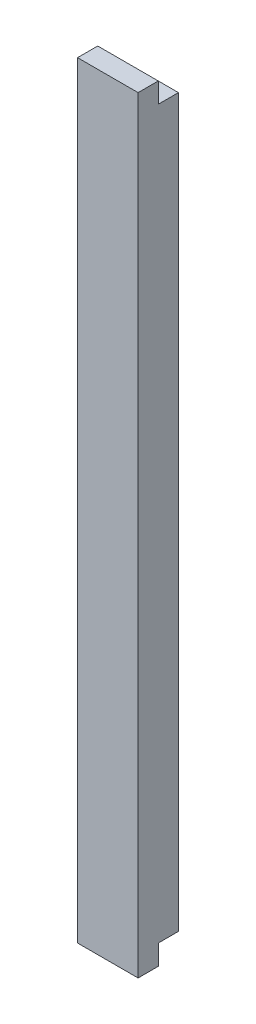
ISO-10303-21;
HEADER;
FILE_DESCRIPTION(('STEP AP214'),'2;1');
FILE_NAME('part.step','',(''),(''),'','','');
FILE_SCHEMA(('AUTOMOTIVE_DESIGN { 1 0 10303 214 1 1 1 1 }'));
ENDSEC;
DATA;
#1=APPLICATION_CONTEXT('core data for automotive mechanical design processes');
#2=APPLICATION_PROTOCOL_DEFINITION('international standard','automotive_design',2000,#1);
#3=PRODUCT_CONTEXT('',#1,'mechanical');
#4=PRODUCT('Part','Part','',(#3));
#5=PRODUCT_RELATED_PRODUCT_CATEGORY('part','',(#4));
#6=PRODUCT_DEFINITION_FORMATION('','',#4);
#7=PRODUCT_DEFINITION_CONTEXT('part definition',#1,'design');
#8=PRODUCT_DEFINITION('design','',#6,#7);
#9=PRODUCT_DEFINITION_SHAPE('','',#8);
#10=(LENGTH_UNIT() NAMED_UNIT(*) SI_UNIT(.MILLI.,.METRE.));
#11=(NAMED_UNIT(*) PLANE_ANGLE_UNIT() SI_UNIT($,.RADIAN.));
#12=(NAMED_UNIT(*) SI_UNIT($,.STERADIAN.) SOLID_ANGLE_UNIT());
#13=UNCERTAINTY_MEASURE_WITH_UNIT(LENGTH_MEASURE(1.E-05),#10,'distance_accuracy_value','');
#14=(GEOMETRIC_REPRESENTATION_CONTEXT(3) GLOBAL_UNCERTAINTY_ASSIGNED_CONTEXT((#13)) GLOBAL_UNIT_ASSIGNED_CONTEXT((#10,
#11,#12)) REPRESENTATION_CONTEXT('',''));
#15=CARTESIAN_POINT('',(0.,0.,0.));
#16=DIRECTION('',(0.,0.,1.));
#17=DIRECTION('',(1.,0.,0.));
#18=AXIS2_PLACEMENT_3D('',#15,#16,#17);
#19=CARTESIAN_POINT('',(20.0000000000001,-190.,20.));
#20=DIRECTION('',(0.,1.,0.));
#21=DIRECTION('',(0.,0.,1.));
#22=AXIS2_PLACEMENT_3D('',#19,#20,#21);
#23=PLANE('',#22);
#24=DIRECTION('',(-1.,0.,0.));
#25=VECTOR('',#24,1.);
#26=CARTESIAN_POINT('',(20.0000000000001,-190.,10.));
#27=LINE('',#26,#25);
#28=CARTESIAN_POINT('',(20.0000000000001,-190.,10.));
#29=VERTEX_POINT('',#28);
#30=CARTESIAN_POINT('',(-10.,-190.,10.));
#31=VERTEX_POINT('',#30);
#32=EDGE_CURVE('E164',#29,#31,#27,.T.);
#33=ORIENTED_EDGE('',*,*,#32,.F.);
#34=DIRECTION('',(0.,0.,-1.));
#35=VECTOR('',#34,1.);
#36=CARTESIAN_POINT('',(20.0000000000001,-190.,20.));
#37=LINE('',#36,#35);
#38=CARTESIAN_POINT('',(20.0000000000001,-190.,20.));
#39=VERTEX_POINT('',#38);
#40=EDGE_CURVE('E43',#39,#29,#37,.T.);
#41=ORIENTED_EDGE('',*,*,#40,.F.);
#42=DIRECTION('',(1.,0.,0.));
#43=VECTOR('',#42,1.);
#44=CARTESIAN_POINT('',(20.0000000000001,-190.,20.));
#45=LINE('',#44,#43);
#46=CARTESIAN_POINT('',(-10.,-190.,20.));
#47=VERTEX_POINT('',#46);
#48=EDGE_CURVE('E139',#47,#39,#45,.T.);
#49=ORIENTED_EDGE('',*,*,#48,.F.);
#50=DIRECTION('',(0.,0.,1.));
#51=VECTOR('',#50,1.);
#52=CARTESIAN_POINT('',(-10.,-190.,10.));
#53=LINE('',#52,#51);
#54=EDGE_CURVE('E133',#31,#47,#53,.T.);
#55=ORIENTED_EDGE('',*,*,#54,.F.);
#56=EDGE_LOOP('',(#33,#41,#49,#55));
#57=FACE_BOUND('',#56,.T.);
#58=ADVANCED_FACE('F35',(#57),#23,.F.);
#59=CARTESIAN_POINT('',(-20.0000000000001,190.,20.));
#60=DIRECTION('',(0.,-1.,0.));
#61=DIRECTION('',(0.,0.,-1.));
#62=AXIS2_PLACEMENT_3D('',#59,#60,#61);
#63=PLANE('',#62);
#64=DIRECTION('',(1.,0.,0.));
#65=VECTOR('',#64,1.);
#66=CARTESIAN_POINT('',(-20.0000000000001,190.,10.));
#67=LINE('',#66,#65);
#68=CARTESIAN_POINT('',(-10.,190.,10.));
#69=VERTEX_POINT('',#68);
#70=CARTESIAN_POINT('',(20.0000000000001,190.,10.));
#71=VERTEX_POINT('',#70);
#72=EDGE_CURVE('E173',#69,#71,#67,.T.);
#73=ORIENTED_EDGE('',*,*,#72,.F.);
#74=DIRECTION('',(0.,0.,1.));
#75=VECTOR('',#74,1.);
#76=CARTESIAN_POINT('',(-10.0000000000001,190.,10.));
#77=LINE('',#76,#75);
#78=CARTESIAN_POINT('',(-10.0000000000001,190.,20.));
#79=VERTEX_POINT('',#78);
#80=EDGE_CURVE('E135',#69,#79,#77,.T.);
#81=ORIENTED_EDGE('',*,*,#80,.T.);
#82=DIRECTION('',(-1.,0.,0.));
#83=VECTOR('',#82,1.);
#84=CARTESIAN_POINT('',(-20.0000000000001,190.,20.));
#85=LINE('',#84,#83);
#86=CARTESIAN_POINT('',(20.0000000000001,190.,20.));
#87=VERTEX_POINT('',#86);
#88=EDGE_CURVE('E144',#87,#79,#85,.T.);
#89=ORIENTED_EDGE('',*,*,#88,.F.);
#90=DIRECTION('',(0.,0.,-1.));
#91=VECTOR('',#90,1.);
#92=CARTESIAN_POINT('',(20.0000000000001,190.,20.));
#93=LINE('',#92,#91);
#94=EDGE_CURVE('E147',#87,#71,#93,.T.);
#95=ORIENTED_EDGE('',*,*,#94,.T.);
#96=EDGE_LOOP('',(#73,#81,#89,#95));
#97=FACE_BOUND('',#96,.T.);
#98=ADVANCED_FACE('F203',(#97),#63,.F.);
#99=CARTESIAN_POINT('',(-20.0000000000001,-190.,20.));
#100=DIRECTION('',(1.,0.,0.));
#101=DIRECTION('',(0.,0.,-1.));
#102=AXIS2_PLACEMENT_3D('',#99,#100,#101);
#103=PLANE('',#102);
#104=DIRECTION('',(0.,-1.,0.));
#105=VECTOR('',#104,1.);
#106=CARTESIAN_POINT('',(-20.0000000000001,-190.,0.));
#107=LINE('',#106,#105);
#108=CARTESIAN_POINT('',(-20.0000000000001,180.,0.));
#109=VERTEX_POINT('',#108);
#110=CARTESIAN_POINT('',(-20.0000000000001,-180.,0.));
#111=VERTEX_POINT('',#110);
#112=EDGE_CURVE('E119',#109,#111,#107,.T.);
#113=ORIENTED_EDGE('',*,*,#112,.T.);
#114=DIRECTION('',(0.,0.,-1.));
#115=VECTOR('',#114,1.);
#116=CARTESIAN_POINT('',(-20.0000000000001,-180.,10.));
#117=LINE('',#116,#115);
#118=CARTESIAN_POINT('',(-20.0000000000001,-180.,10.));
#119=VERTEX_POINT('',#118);
#120=EDGE_CURVE('E106',#119,#111,#117,.T.);
#121=ORIENTED_EDGE('',*,*,#120,.F.);
#122=DIRECTION('',(0.,-1.,0.));
#123=VECTOR('',#122,1.);
#124=CARTESIAN_POINT('',(-20.0000000000001,190.,10.));
#125=LINE('',#124,#123);
#126=CARTESIAN_POINT('',(-20.0000000000001,180.,10.));
#127=VERTEX_POINT('',#126);
#128=EDGE_CURVE('E117',#127,#119,#125,.T.);
#129=ORIENTED_EDGE('',*,*,#128,.F.);
#130=DIRECTION('',(0.,0.,-1.));
#131=VECTOR('',#130,1.);
#132=CARTESIAN_POINT('',(-20.0000000000001,180.,10.));
#133=LINE('',#132,#131);
#134=EDGE_CURVE('E57',#127,#109,#133,.T.);
#135=ORIENTED_EDGE('',*,*,#134,.T.);
#136=EDGE_LOOP('',(#113,#121,#129,#135));
#137=FACE_BOUND('',#136,.T.);
#138=ADVANCED_FACE('F37',(#137),#103,.F.);
#139=CARTESIAN_POINT('',(20.0000000000001,190.,20.));
#140=DIRECTION('',(-1.,0.,0.));
#141=DIRECTION('',(0.,0.,1.));
#142=AXIS2_PLACEMENT_3D('',#139,#140,#141);
#143=PLANE('',#142);
#144=DIRECTION('',(0.,-1.,0.));
#145=VECTOR('',#144,1.);
#146=CARTESIAN_POINT('',(20.0000000000001,-180.,10.));
#147=LINE('',#146,#145);
#148=CARTESIAN_POINT('',(20.0000000000001,-180.,10.));
#149=VERTEX_POINT('',#148);
#150=EDGE_CURVE('E112',#149,#29,#147,.T.);
#151=ORIENTED_EDGE('',*,*,#150,.F.);
#152=DIRECTION('',(0.,0.,-1.));
#153=VECTOR('',#152,1.);
#154=CARTESIAN_POINT('',(20.0000000000001,-180.,10.));
#155=LINE('',#154,#153);
#156=CARTESIAN_POINT('',(20.0000000000001,-180.,0.));
#157=VERTEX_POINT('',#156);
#158=EDGE_CURVE('E120',#149,#157,#155,.T.);
#159=ORIENTED_EDGE('',*,*,#158,.T.);
#160=DIRECTION('',(0.,1.,0.));
#161=VECTOR('',#160,1.);
#162=CARTESIAN_POINT('',(20.0000000000001,190.,0.));
#163=LINE('',#162,#161);
#164=CARTESIAN_POINT('',(20.0000000000001,180.,0.));
#165=VERTEX_POINT('',#164);
#166=EDGE_CURVE('E142',#157,#165,#163,.T.);
#167=ORIENTED_EDGE('',*,*,#166,.T.);
#168=DIRECTION('',(0.,0.,-1.));
#169=VECTOR('',#168,1.);
#170=CARTESIAN_POINT('',(20.0000000000001,180.,10.));
#171=LINE('',#170,#169);
#172=CARTESIAN_POINT('',(20.0000000000001,180.,10.));
#173=VERTEX_POINT('',#172);
#174=EDGE_CURVE('E131',#173,#165,#171,.T.);
#175=ORIENTED_EDGE('',*,*,#174,.F.);
#176=DIRECTION('',(0.,-1.,0.));
#177=VECTOR('',#176,1.);
#178=CARTESIAN_POINT('',(20.0000000000001,190.,10.));
#179=LINE('',#178,#177);
#180=EDGE_CURVE('E175',#71,#173,#179,.T.);
#181=ORIENTED_EDGE('',*,*,#180,.F.);
#182=ORIENTED_EDGE('',*,*,#94,.F.);
#183=DIRECTION('',(0.,1.,0.));
#184=VECTOR('',#183,1.);
#185=CARTESIAN_POINT('',(20.0000000000001,190.,20.));
#186=LINE('',#185,#184);
#187=EDGE_CURVE('E141',#39,#87,#186,.T.);
#188=ORIENTED_EDGE('',*,*,#187,.F.);
#189=ORIENTED_EDGE('',*,*,#40,.T.);
#190=EDGE_LOOP('',(#151,#159,#167,#175,#181,#182,#188,#189));
#191=FACE_BOUND('',#190,.T.);
#192=ADVANCED_FACE('F157',(#191),#143,.F.);
#193=CARTESIAN_POINT('',(0.,0.,20.));
#194=DIRECTION('',(0.,0.,-1.));
#195=DIRECTION('',(-1.,0.,0.));
#196=AXIS2_PLACEMENT_3D('',#193,#194,#195);
#197=PLANE('',#196);
#198=ORIENTED_EDGE('',*,*,#88,.T.);
#199=DIRECTION('',(0.,1.,0.));
#200=VECTOR('',#199,1.);
#201=CARTESIAN_POINT('',(-10.0000000000001,190.,20.));
#202=LINE('',#201,#200);
#203=EDGE_CURVE('E124',#47,#79,#202,.T.);
#204=ORIENTED_EDGE('',*,*,#203,.F.);
#205=ORIENTED_EDGE('',*,*,#48,.T.);
#206=ORIENTED_EDGE('',*,*,#187,.T.);
#207=EDGE_LOOP('',(#198,#204,#205,#206));
#208=FACE_BOUND('',#207,.T.);
#209=ADVANCED_FACE('F191',(#208),#197,.F.);
#210=CARTESIAN_POINT('',(0.,0.,0.));
#211=DIRECTION('',(0.,0.,-1.));
#212=DIRECTION('',(-1.,0.,0.));
#213=AXIS2_PLACEMENT_3D('',#210,#211,#212);
#214=PLANE('',#213);
#215=DIRECTION('',(1.,0.,0.));
#216=VECTOR('',#215,1.);
#217=CARTESIAN_POINT('',(-20.0000000000001,-180.,0.));
#218=LINE('',#217,#216);
#219=EDGE_CURVE('E167',#111,#157,#218,.T.);
#220=ORIENTED_EDGE('',*,*,#219,.F.);
#221=ORIENTED_EDGE('',*,*,#112,.F.);
#222=DIRECTION('',(-1.,0.,0.));
#223=VECTOR('',#222,1.);
#224=CARTESIAN_POINT('',(20.0000000000001,180.,0.));
#225=LINE('',#224,#223);
#226=EDGE_CURVE('E176',#165,#109,#225,.T.);
#227=ORIENTED_EDGE('',*,*,#226,.F.);
#228=ORIENTED_EDGE('',*,*,#166,.F.);
#229=EDGE_LOOP('',(#220,#221,#227,#228));
#230=FACE_BOUND('',#229,.T.);
#231=ADVANCED_FACE('F188',(#230),#214,.T.);
#232=CARTESIAN_POINT('',(-10.0000000000001,190.,10.));
#233=DIRECTION('',(1.,0.,0.));
#234=DIRECTION('',(0.,1.,0.));
#235=AXIS2_PLACEMENT_3D('',#232,#233,#234);
#236=PLANE('',#235);
#237=ORIENTED_EDGE('',*,*,#203,.T.);
#238=ORIENTED_EDGE('',*,*,#80,.F.);
#239=DIRECTION('',(0.,1.,0.));
#240=VECTOR('',#239,1.);
#241=CARTESIAN_POINT('',(-10.0000000000001,190.,10.));
#242=LINE('',#241,#240);
#243=CARTESIAN_POINT('',(-10.,180.,10.));
#244=VERTEX_POINT('',#243);
#245=EDGE_CURVE('E123',#244,#69,#242,.T.);
#246=ORIENTED_EDGE('',*,*,#245,.F.);
#247=CARTESIAN_POINT('',(-10.,-180.,10.));
#248=VERTEX_POINT('',#247);
#249=EDGE_CURVE('E126',#248,#244,#242,.T.);
#250=ORIENTED_EDGE('',*,*,#249,.F.);
#251=EDGE_CURVE('E128',#31,#248,#242,.T.);
#252=ORIENTED_EDGE('',*,*,#251,.F.);
#253=ORIENTED_EDGE('',*,*,#54,.T.);
#254=EDGE_LOOP('',(#237,#238,#246,#250,#252,#253));
#255=FACE_BOUND('',#254,.T.);
#256=ADVANCED_FACE('F190',(#255),#236,.F.);
#257=CARTESIAN_POINT('',(0.,0.,10.));
#258=DIRECTION('',(0.,0.,1.));
#259=DIRECTION('',(1.,0.,0.));
#260=AXIS2_PLACEMENT_3D('',#257,#258,#259);
#261=PLANE('',#260);
#262=DIRECTION('',(1.,0.,0.));
#263=VECTOR('',#262,1.);
#264=CARTESIAN_POINT('',(-20.0000000000001,-180.,10.));
#265=LINE('',#264,#263);
#266=EDGE_CURVE('E103',#119,#248,#265,.T.);
#267=ORIENTED_EDGE('',*,*,#266,.T.);
#268=ORIENTED_EDGE('',*,*,#249,.T.);
#269=DIRECTION('',(1.,0.,0.));
#270=VECTOR('',#269,1.);
#271=CARTESIAN_POINT('',(0.,180.,10.));
#272=LINE('',#271,#270);
#273=EDGE_CURVE('E11',#127,#244,#272,.T.);
#274=ORIENTED_EDGE('',*,*,#273,.F.);
#275=ORIENTED_EDGE('',*,*,#128,.T.);
#276=EDGE_LOOP('',(#267,#268,#274,#275));
#277=FACE_BOUND('',#276,.T.);
#278=ADVANCED_FACE('F122',(#277),#261,.T.);
#279=CARTESIAN_POINT('',(0.,0.,10.));
#280=DIRECTION('',(0.,0.,-1.));
#281=DIRECTION('',(-1.,0.,0.));
#282=AXIS2_PLACEMENT_3D('',#279,#280,#281);
#283=PLANE('',#282);
#284=ORIENTED_EDGE('',*,*,#245,.T.);
#285=ORIENTED_EDGE('',*,*,#72,.T.);
#286=ORIENTED_EDGE('',*,*,#180,.T.);
#287=DIRECTION('',(-1.,0.,0.));
#288=VECTOR('',#287,1.);
#289=CARTESIAN_POINT('',(20.0000000000001,180.,10.));
#290=LINE('',#289,#288);
#291=EDGE_CURVE('E179',#173,#244,#290,.T.);
#292=ORIENTED_EDGE('',*,*,#291,.T.);
#293=EDGE_LOOP('',(#284,#285,#286,#292));
#294=FACE_BOUND('',#293,.T.);
#295=ADVANCED_FACE('F253',(#294),#283,.T.);
#296=CARTESIAN_POINT('',(20.0000000000001,180.,10.));
#297=DIRECTION('',(0.,-1.,0.));
#298=DIRECTION('',(0.,0.,-1.));
#299=AXIS2_PLACEMENT_3D('',#296,#297,#298);
#300=PLANE('',#299);
#301=ORIENTED_EDGE('',*,*,#226,.T.);
#302=ORIENTED_EDGE('',*,*,#134,.F.);
#303=ORIENTED_EDGE('',*,*,#273,.T.);
#304=ORIENTED_EDGE('',*,*,#291,.F.);
#305=ORIENTED_EDGE('',*,*,#174,.T.);
#306=EDGE_LOOP('',(#301,#302,#303,#304,#305));
#307=FACE_BOUND('',#306,.T.);
#308=ADVANCED_FACE('F184',(#307),#300,.F.);
#309=CARTESIAN_POINT('',(0.,0.,10.));
#310=DIRECTION('',(0.,0.,-1.));
#311=DIRECTION('',(-1.,0.,0.));
#312=AXIS2_PLACEMENT_3D('',#309,#310,#311);
#313=PLANE('',#312);
#314=ORIENTED_EDGE('',*,*,#251,.T.);
#315=EDGE_CURVE('E50',#248,#149,#265,.T.);
#316=ORIENTED_EDGE('',*,*,#315,.T.);
#317=ORIENTED_EDGE('',*,*,#150,.T.);
#318=ORIENTED_EDGE('',*,*,#32,.T.);
#319=EDGE_LOOP('',(#314,#316,#317,#318));
#320=FACE_BOUND('',#319,.T.);
#321=ADVANCED_FACE('F270',(#320),#313,.T.);
#322=CARTESIAN_POINT('',(-20.0000000000001,-180.,10.));
#323=DIRECTION('',(0.,1.,0.));
#324=DIRECTION('',(0.,0.,1.));
#325=AXIS2_PLACEMENT_3D('',#322,#323,#324);
#326=PLANE('',#325);
#327=ORIENTED_EDGE('',*,*,#219,.T.);
#328=ORIENTED_EDGE('',*,*,#158,.F.);
#329=ORIENTED_EDGE('',*,*,#315,.F.);
#330=ORIENTED_EDGE('',*,*,#266,.F.);
#331=ORIENTED_EDGE('',*,*,#120,.T.);
#332=EDGE_LOOP('',(#327,#328,#329,#330,#331));
#333=FACE_BOUND('',#332,.T.);
#334=ADVANCED_FACE('F105',(#333),#326,.F.);
#335=CLOSED_SHELL('',(#58,#98,#138,#192,#209,#231,#256,#278,#295,#308,#321,#334));
#336=MANIFOLD_SOLID_BREP('B2',#335);
#337=ADVANCED_BREP_SHAPE_REPRESENTATION('',(#18,#336),#14);
#338=SHAPE_DEFINITION_REPRESENTATION(#9,#337);
ENDSEC;
END-ISO-10303-21;
